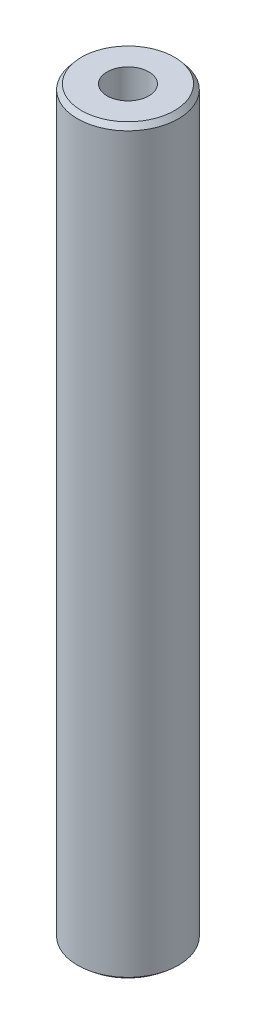
ISO-10303-21;
HEADER;
FILE_DESCRIPTION(('STEP AP214'),'2;1');
FILE_NAME('part.step','',(''),(''),'','','');
FILE_SCHEMA(('AUTOMOTIVE_DESIGN { 1 0 10303 214 1 1 1 1 }'));
ENDSEC;
DATA;
#1=APPLICATION_CONTEXT('core data for automotive mechanical design processes');
#2=APPLICATION_PROTOCOL_DEFINITION('international standard','automotive_design',2000,#1);
#3=PRODUCT_CONTEXT('',#1,'mechanical');
#4=PRODUCT('Part','Part','',(#3));
#5=PRODUCT_RELATED_PRODUCT_CATEGORY('part','',(#4));
#6=PRODUCT_DEFINITION_FORMATION('','',#4);
#7=PRODUCT_DEFINITION_CONTEXT('part definition',#1,'design');
#8=PRODUCT_DEFINITION('design','',#6,#7);
#9=PRODUCT_DEFINITION_SHAPE('','',#8);
#10=(LENGTH_UNIT() NAMED_UNIT(*) SI_UNIT(.MILLI.,.METRE.));
#11=(NAMED_UNIT(*) PLANE_ANGLE_UNIT() SI_UNIT($,.RADIAN.));
#12=(NAMED_UNIT(*) SI_UNIT($,.STERADIAN.) SOLID_ANGLE_UNIT());
#13=UNCERTAINTY_MEASURE_WITH_UNIT(LENGTH_MEASURE(1.E-05),#10,'distance_accuracy_value','');
#14=(GEOMETRIC_REPRESENTATION_CONTEXT(3) GLOBAL_UNCERTAINTY_ASSIGNED_CONTEXT((#13)) GLOBAL_UNIT_ASSIGNED_CONTEXT((#10,
#11,#12)) REPRESENTATION_CONTEXT('',''));
#15=CARTESIAN_POINT('',(0.,0.,0.));
#16=DIRECTION('',(0.,0.,1.));
#17=DIRECTION('',(1.,0.,0.));
#18=AXIS2_PLACEMENT_3D('',#15,#16,#17);
#19=CARTESIAN_POINT('',(0.,477.664512004871,0.));
#20=DIRECTION('',(0.,-1.,0.));
#21=DIRECTION('',(0.,0.,-1.));
#22=AXIS2_PLACEMENT_3D('',#19,#20,#21);
#23=CYLINDRICAL_SURFACE('',#22,32.5);
#24=CARTESIAN_POINT('',(0.,474.460777672065,0.));
#25=DIRECTION('',(0.,1.,0.));
#26=DIRECTION('',(0.,0.,1.));
#27=AXIS2_PLACEMENT_3D('',#24,#25,#26);
#28=CIRCLE('',#27,32.5);
#29=CARTESIAN_POINT('',(0.,474.460777672065,32.5));
#30=VERTEX_POINT('',#29);
#31=EDGE_CURVE('E50',#30,#30,#28,.F.);
#32=ORIENTED_EDGE('',*,*,#31,.T.);
#33=EDGE_LOOP('',(#32));
#34=FACE_BOUND('',#33,.T.);
#35=CARTESIAN_POINT('',(0.,2.63201303210209,0.));
#36=DIRECTION('',(0.,1.,0.));
#37=DIRECTION('',(0.,0.,1.));
#38=AXIS2_PLACEMENT_3D('',#35,#36,#37);
#39=CIRCLE('',#38,32.5);
#40=CARTESIAN_POINT('',(0.,2.63201303210209,32.5));
#41=VERTEX_POINT('',#40);
#42=EDGE_CURVE('E51',#41,#41,#39,.T.);
#43=ORIENTED_EDGE('',*,*,#42,.T.);
#44=EDGE_LOOP('',(#43));
#45=FACE_BOUND('',#44,.T.);
#46=ADVANCED_FACE('F39',(#34,#45),#23,.T.);
#47=CARTESIAN_POINT('',(0.,477.664512004871,0.));
#48=DIRECTION('',(0.,1.,0.));
#49=DIRECTION('',(0.,0.,1.));
#50=AXIS2_PLACEMENT_3D('',#47,#48,#49);
#51=PLANE('',#50);
#52=CARTESIAN_POINT('',(0.,477.664512004871,0.));
#53=DIRECTION('',(0.,1.,0.));
#54=DIRECTION('',(0.,0.,1.));
#55=AXIS2_PLACEMENT_3D('',#52,#53,#54);
#56=CIRCLE('',#55,29.867986967898);
#57=CARTESIAN_POINT('',(0.,477.664512004871,29.867986967898));
#58=VERTEX_POINT('',#57);
#59=EDGE_CURVE('E54',#58,#58,#56,.T.);
#60=ORIENTED_EDGE('',*,*,#59,.T.);
#61=EDGE_LOOP('',(#60));
#62=FACE_BOUND('',#61,.T.);
#63=CARTESIAN_POINT('',(0.,477.664512004871,0.));
#64=DIRECTION('',(0.,1.,0.));
#65=DIRECTION('',(0.,0.,1.));
#66=AXIS2_PLACEMENT_3D('',#63,#64,#65);
#67=CIRCLE('',#66,13.4325416399791);
#68=CARTESIAN_POINT('',(0.,477.664512004871,13.4325416399791));
#69=VERTEX_POINT('',#68);
#70=EDGE_CURVE('E58',#69,#69,#67,.T.);
#71=ORIENTED_EDGE('',*,*,#70,.F.);
#72=EDGE_LOOP('',(#71));
#73=FACE_BOUND('',#72,.T.);
#74=ADVANCED_FACE('F69',(#62,#73),#51,.T.);
#75=CARTESIAN_POINT('',(0.,0.,0.));
#76=DIRECTION('',(0.,1.,0.));
#77=DIRECTION('',(0.,0.,1.));
#78=AXIS2_PLACEMENT_3D('',#75,#76,#77);
#79=PLANE('',#78);
#80=CARTESIAN_POINT('',(0.,0.,0.));
#81=DIRECTION('',(0.,1.,0.));
#82=DIRECTION('',(0.,0.,1.));
#83=AXIS2_PLACEMENT_3D('',#80,#81,#82);
#84=CIRCLE('',#83,29.296265667194);
#85=CARTESIAN_POINT('',(0.,0.,29.296265667194));
#86=VERTEX_POINT('',#85);
#87=EDGE_CURVE('E10',#86,#86,#84,.F.);
#88=ORIENTED_EDGE('',*,*,#87,.T.);
#89=EDGE_LOOP('',(#88));
#90=FACE_BOUND('',#89,.T.);
#91=CARTESIAN_POINT('',(0.,0.,0.));
#92=DIRECTION('',(0.,1.,0.));
#93=DIRECTION('',(0.,0.,1.));
#94=AXIS2_PLACEMENT_3D('',#91,#92,#93);
#95=CIRCLE('',#94,13.4325416399791);
#96=CARTESIAN_POINT('',(0.,0.,13.4325416399791));
#97=VERTEX_POINT('',#96);
#98=EDGE_CURVE('E63',#97,#97,#95,.T.);
#99=ORIENTED_EDGE('',*,*,#98,.T.);
#100=EDGE_LOOP('',(#99));
#101=FACE_BOUND('',#100,.T.);
#102=ADVANCED_FACE('F75',(#90,#101),#79,.F.);
#103=CARTESIAN_POINT('',(0.,477.664512004871,0.));
#104=DIRECTION('',(0.,-1.,0.));
#105=DIRECTION('',(0.,0.,-1.));
#106=AXIS2_PLACEMENT_3D('',#103,#104,#105);
#107=CYLINDRICAL_SURFACE('',#106,13.4325416399791);
#108=ORIENTED_EDGE('',*,*,#70,.T.);
#109=EDGE_LOOP('',(#108));
#110=FACE_BOUND('',#109,.T.);
#111=ORIENTED_EDGE('',*,*,#98,.F.);
#112=EDGE_LOOP('',(#111));
#113=FACE_BOUND('',#112,.T.);
#114=ADVANCED_FACE('F70',(#110,#113),#107,.F.);
#115=CARTESIAN_POINT('',(0.,477.664512004871,0.));
#116=DIRECTION('',(0.,-1.,0.));
#117=DIRECTION('',(0.,0.,-1.));
#118=AXIS2_PLACEMENT_3D('',#115,#116,#117);
#119=CONICAL_SURFACE('',#118,29.867986967898,0.687740979043698);
#120=ORIENTED_EDGE('',*,*,#31,.F.);
#121=EDGE_LOOP('',(#120));
#122=FACE_BOUND('',#121,.T.);
#123=ORIENTED_EDGE('',*,*,#59,.F.);
#124=EDGE_LOOP('',(#123));
#125=FACE_BOUND('',#124,.T.);
#126=ADVANCED_FACE('F81',(#122,#125),#119,.T.);
#127=CARTESIAN_POINT('',(0.,2.63201303210209,0.));
#128=DIRECTION('',(0.,1.,0.));
#129=DIRECTION('',(0.,0.,1.));
#130=AXIS2_PLACEMENT_3D('',#127,#128,#129);
#131=CONICAL_SURFACE('',#130,32.5,0.883055347751187);
#132=ORIENTED_EDGE('',*,*,#87,.F.);
#133=EDGE_LOOP('',(#132));
#134=FACE_BOUND('',#133,.T.);
#135=ORIENTED_EDGE('',*,*,#42,.F.);
#136=EDGE_LOOP('',(#135));
#137=FACE_BOUND('',#136,.T.);
#138=ADVANCED_FACE('F45',(#134,#137),#131,.T.);
#139=CLOSED_SHELL('',(#46,#74,#102,#114,#126,#138));
#140=MANIFOLD_SOLID_BREP('B2',#139);
#141=ADVANCED_BREP_SHAPE_REPRESENTATION('',(#18,#140),#14);
#142=SHAPE_DEFINITION_REPRESENTATION(#9,#141);
ENDSEC;
END-ISO-10303-21;
